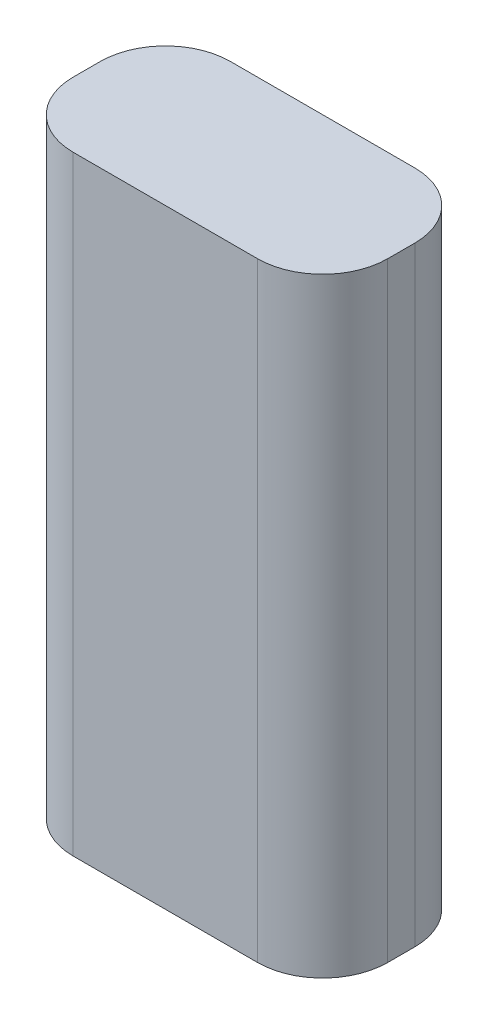
ISO-10303-21;
HEADER;
FILE_DESCRIPTION(('STEP AP214'),'2;1');
FILE_NAME('part.step','',(''),(''),'','','');
FILE_SCHEMA(('AUTOMOTIVE_DESIGN { 1 0 10303 214 1 1 1 1 }'));
ENDSEC;
DATA;
#1=APPLICATION_CONTEXT('core data for automotive mechanical design processes');
#2=APPLICATION_PROTOCOL_DEFINITION('international standard','automotive_design',2000,#1);
#3=PRODUCT_CONTEXT('',#1,'mechanical');
#4=PRODUCT('Part','Part','',(#3));
#5=PRODUCT_RELATED_PRODUCT_CATEGORY('part','',(#4));
#6=PRODUCT_DEFINITION_FORMATION('','',#4);
#7=PRODUCT_DEFINITION_CONTEXT('part definition',#1,'design');
#8=PRODUCT_DEFINITION('design','',#6,#7);
#9=PRODUCT_DEFINITION_SHAPE('','',#8);
#10=(LENGTH_UNIT() NAMED_UNIT(*) SI_UNIT(.MILLI.,.METRE.));
#11=(NAMED_UNIT(*) PLANE_ANGLE_UNIT() SI_UNIT($,.RADIAN.));
#12=(NAMED_UNIT(*) SI_UNIT($,.STERADIAN.) SOLID_ANGLE_UNIT());
#13=UNCERTAINTY_MEASURE_WITH_UNIT(LENGTH_MEASURE(1.E-05),#10,'distance_accuracy_value','');
#14=(GEOMETRIC_REPRESENTATION_CONTEXT(3) GLOBAL_UNCERTAINTY_ASSIGNED_CONTEXT((#13)) GLOBAL_UNIT_ASSIGNED_CONTEXT((#10,
#11,#12)) REPRESENTATION_CONTEXT('',''));
#15=CARTESIAN_POINT('',(0.,0.,0.));
#16=DIRECTION('',(0.,0.,1.));
#17=DIRECTION('',(1.,0.,0.));
#18=AXIS2_PLACEMENT_3D('',#15,#16,#17);
#19=CARTESIAN_POINT('',(0.,0.,18.415));
#20=DIRECTION('',(1.,0.,0.));
#21=DIRECTION('',(0.,1.,0.));
#22=AXIS2_PLACEMENT_3D('',#19,#20,#21);
#23=PLANE('',#22);
#24=DIRECTION('',(0.,0.,-1.));
#25=VECTOR('',#24,1.);
#26=CARTESIAN_POINT('',(0.,0.,18.415));
#27=LINE('',#26,#25);
#28=CARTESIAN_POINT('',(0.,0.,10.795));
#29=VERTEX_POINT('',#28);
#30=CARTESIAN_POINT('',(0.,0.,7.62));
#31=VERTEX_POINT('',#30);
#32=EDGE_CURVE('E182',#29,#31,#27,.T.);
#33=ORIENTED_EDGE('',*,*,#32,.T.);
#34=DIRECTION('',(0.,-1.,0.));
#35=VECTOR('',#34,1.);
#36=CARTESIAN_POINT('',(0.,0.,7.62));
#37=LINE('',#36,#35);
#38=CARTESIAN_POINT('',(0.,-71.374,7.62));
#39=VERTEX_POINT('',#38);
#40=EDGE_CURVE('E130',#31,#39,#37,.T.);
#41=ORIENTED_EDGE('',*,*,#40,.T.);
#42=DIRECTION('',(0.,0.,-1.));
#43=VECTOR('',#42,1.);
#44=CARTESIAN_POINT('',(0.,-71.374,18.415));
#45=LINE('',#44,#43);
#46=CARTESIAN_POINT('',(0.,-71.374,10.795));
#47=VERTEX_POINT('',#46);
#48=EDGE_CURVE('E114',#47,#39,#45,.T.);
#49=ORIENTED_EDGE('',*,*,#48,.F.);
#50=DIRECTION('',(0.,-1.,0.));
#51=VECTOR('',#50,1.);
#52=CARTESIAN_POINT('',(0.,0.,10.795));
#53=LINE('',#52,#51);
#54=EDGE_CURVE('E127',#47,#29,#53,.F.);
#55=ORIENTED_EDGE('',*,*,#54,.T.);
#56=EDGE_LOOP('',(#33,#41,#49,#55));
#57=FACE_BOUND('',#56,.T.);
#58=ADVANCED_FACE('F43',(#57),#23,.F.);
#59=CARTESIAN_POINT('',(0.,-71.374,18.415));
#60=DIRECTION('',(0.,1.,0.));
#61=DIRECTION('',(0.,0.,1.));
#62=AXIS2_PLACEMENT_3D('',#59,#60,#61);
#63=PLANE('',#62);
#64=ORIENTED_EDGE('',*,*,#48,.T.);
#65=CARTESIAN_POINT('',(7.62000000000001,-71.374,7.62));
#66=DIRECTION('',(0.,1.,0.));
#67=DIRECTION('',(0.,0.,1.));
#68=AXIS2_PLACEMENT_3D('',#65,#66,#67);
#69=CIRCLE('',#68,7.62);
#70=CARTESIAN_POINT('',(7.62000000000001,-71.374,0.));
#71=VERTEX_POINT('',#70);
#72=EDGE_CURVE('E147',#39,#71,#69,.F.);
#73=ORIENTED_EDGE('',*,*,#72,.T.);
#74=DIRECTION('',(1.,0.,0.));
#75=VECTOR('',#74,1.);
#76=CARTESIAN_POINT('',(0.,-71.374,0.));
#77=LINE('',#76,#75);
#78=CARTESIAN_POINT('',(29.21,-71.374,0.));
#79=VERTEX_POINT('',#78);
#80=EDGE_CURVE('E191',#71,#79,#77,.T.);
#81=ORIENTED_EDGE('',*,*,#80,.T.);
#82=CARTESIAN_POINT('',(29.21,-71.374,7.62));
#83=DIRECTION('',(0.,1.,0.));
#84=DIRECTION('',(0.,0.,1.));
#85=AXIS2_PLACEMENT_3D('',#82,#83,#84);
#86=CIRCLE('',#85,7.62);
#87=CARTESIAN_POINT('',(36.83,-71.374,7.62));
#88=VERTEX_POINT('',#87);
#89=EDGE_CURVE('E121',#79,#88,#86,.F.);
#90=ORIENTED_EDGE('',*,*,#89,.T.);
#91=DIRECTION('',(0.,0.,-1.));
#92=VECTOR('',#91,1.);
#93=CARTESIAN_POINT('',(36.83,-71.374,18.415));
#94=LINE('',#93,#92);
#95=CARTESIAN_POINT('',(36.83,-71.374,10.795));
#96=VERTEX_POINT('',#95);
#97=EDGE_CURVE('E132',#96,#88,#94,.T.);
#98=ORIENTED_EDGE('',*,*,#97,.F.);
#99=CARTESIAN_POINT('',(29.21,-71.374,10.795));
#100=DIRECTION('',(0.,1.,0.));
#101=DIRECTION('',(0.,0.,1.));
#102=AXIS2_PLACEMENT_3D('',#99,#100,#101);
#103=CIRCLE('',#102,7.62);
#104=CARTESIAN_POINT('',(29.21,-71.374,18.415));
#105=VERTEX_POINT('',#104);
#106=EDGE_CURVE('E122',#96,#105,#103,.F.);
#107=ORIENTED_EDGE('',*,*,#106,.T.);
#108=DIRECTION('',(1.,0.,0.));
#109=VECTOR('',#108,1.);
#110=CARTESIAN_POINT('',(0.,-71.374,18.415));
#111=LINE('',#110,#109);
#112=CARTESIAN_POINT('',(7.62000000000001,-71.374,18.415));
#113=VERTEX_POINT('',#112);
#114=EDGE_CURVE('E116',#113,#105,#111,.T.);
#115=ORIENTED_EDGE('',*,*,#114,.F.);
#116=CARTESIAN_POINT('',(7.62000000000001,-71.374,10.795));
#117=DIRECTION('',(0.,1.,0.));
#118=DIRECTION('',(0.,0.,1.));
#119=AXIS2_PLACEMENT_3D('',#116,#117,#118);
#120=CIRCLE('',#119,7.62);
#121=EDGE_CURVE('E111',#113,#47,#120,.F.);
#122=ORIENTED_EDGE('',*,*,#121,.T.);
#123=EDGE_LOOP('',(#64,#73,#81,#90,#98,#107,#115,#122));
#124=FACE_BOUND('',#123,.T.);
#125=ADVANCED_FACE('F113',(#124),#63,.F.);
#126=CARTESIAN_POINT('',(36.83,0.,18.415));
#127=DIRECTION('',(-1.,0.,0.));
#128=DIRECTION('',(0.,0.,1.));
#129=AXIS2_PLACEMENT_3D('',#126,#127,#128);
#130=PLANE('',#129);
#131=ORIENTED_EDGE('',*,*,#97,.T.);
#132=DIRECTION('',(0.,1.,0.));
#133=VECTOR('',#132,1.);
#134=CARTESIAN_POINT('',(36.83,0.,7.62));
#135=LINE('',#134,#133);
#136=CARTESIAN_POINT('',(36.83,0.,7.62));
#137=VERTEX_POINT('',#136);
#138=EDGE_CURVE('E168',#88,#137,#135,.T.);
#139=ORIENTED_EDGE('',*,*,#138,.T.);
#140=DIRECTION('',(0.,0.,-1.));
#141=VECTOR('',#140,1.);
#142=CARTESIAN_POINT('',(36.83,0.,18.415));
#143=LINE('',#142,#141);
#144=CARTESIAN_POINT('',(36.83,0.,10.795));
#145=VERTEX_POINT('',#144);
#146=EDGE_CURVE('E186',#145,#137,#143,.T.);
#147=ORIENTED_EDGE('',*,*,#146,.F.);
#148=DIRECTION('',(0.,1.,0.));
#149=VECTOR('',#148,1.);
#150=CARTESIAN_POINT('',(36.83,-71.374,10.795));
#151=LINE('',#150,#149);
#152=EDGE_CURVE('E165',#145,#96,#151,.F.);
#153=ORIENTED_EDGE('',*,*,#152,.T.);
#154=EDGE_LOOP('',(#131,#139,#147,#153));
#155=FACE_BOUND('',#154,.T.);
#156=ADVANCED_FACE('F202',(#155),#130,.F.);
#157=CARTESIAN_POINT('',(0.,0.,18.415));
#158=DIRECTION('',(0.,-1.,0.));
#159=DIRECTION('',(0.,0.,-1.));
#160=AXIS2_PLACEMENT_3D('',#157,#158,#159);
#161=PLANE('',#160);
#162=DIRECTION('',(-1.,0.,0.));
#163=VECTOR('',#162,1.);
#164=CARTESIAN_POINT('',(0.,0.,0.));
#165=LINE('',#164,#163);
#166=CARTESIAN_POINT('',(29.21,0.,0.));
#167=VERTEX_POINT('',#166);
#168=CARTESIAN_POINT('',(7.62,0.,0.));
#169=VERTEX_POINT('',#168);
#170=EDGE_CURVE('E188',#167,#169,#165,.T.);
#171=ORIENTED_EDGE('',*,*,#170,.T.);
#172=CARTESIAN_POINT('',(7.62,0.,7.62));
#173=DIRECTION('',(0.,-1.,0.));
#174=DIRECTION('',(0.,0.,-1.));
#175=AXIS2_PLACEMENT_3D('',#172,#173,#174);
#176=CIRCLE('',#175,7.62);
#177=EDGE_CURVE('E162',#169,#31,#176,.F.);
#178=ORIENTED_EDGE('',*,*,#177,.T.);
#179=ORIENTED_EDGE('',*,*,#32,.F.);
#180=CARTESIAN_POINT('',(7.62,0.,10.795));
#181=DIRECTION('',(0.,-1.,0.));
#182=DIRECTION('',(0.,0.,-1.));
#183=AXIS2_PLACEMENT_3D('',#180,#181,#182);
#184=CIRCLE('',#183,7.62);
#185=CARTESIAN_POINT('',(7.62,0.,18.415));
#186=VERTEX_POINT('',#185);
#187=EDGE_CURVE('E136',#29,#186,#184,.F.);
#188=ORIENTED_EDGE('',*,*,#187,.T.);
#189=DIRECTION('',(-1.,0.,0.));
#190=VECTOR('',#189,1.);
#191=CARTESIAN_POINT('',(0.,0.,18.415));
#192=LINE('',#191,#190);
#193=CARTESIAN_POINT('',(29.21,0.,18.415));
#194=VERTEX_POINT('',#193);
#195=EDGE_CURVE('E176',#194,#186,#192,.T.);
#196=ORIENTED_EDGE('',*,*,#195,.F.);
#197=CARTESIAN_POINT('',(29.21,0.,10.795));
#198=DIRECTION('',(0.,-1.,0.));
#199=DIRECTION('',(0.,0.,-1.));
#200=AXIS2_PLACEMENT_3D('',#197,#198,#199);
#201=CIRCLE('',#200,7.62);
#202=EDGE_CURVE('E67',#194,#145,#201,.F.);
#203=ORIENTED_EDGE('',*,*,#202,.T.);
#204=ORIENTED_EDGE('',*,*,#146,.T.);
#205=CARTESIAN_POINT('',(29.21,0.,7.62));
#206=DIRECTION('',(0.,-1.,0.));
#207=DIRECTION('',(0.,0.,-1.));
#208=AXIS2_PLACEMENT_3D('',#205,#206,#207);
#209=CIRCLE('',#208,7.62);
#210=EDGE_CURVE('E59',#137,#167,#209,.F.);
#211=ORIENTED_EDGE('',*,*,#210,.T.);
#212=EDGE_LOOP('',(#171,#178,#179,#188,#196,#203,#204,#211));
#213=FACE_BOUND('',#212,.T.);
#214=ADVANCED_FACE('F180',(#213),#161,.F.);
#215=CARTESIAN_POINT('',(0.,0.,18.415));
#216=DIRECTION('',(0.,0.,1.));
#217=DIRECTION('',(1.,0.,0.));
#218=AXIS2_PLACEMENT_3D('',#215,#216,#217);
#219=PLANE('',#218);
#220=ORIENTED_EDGE('',*,*,#195,.T.);
#221=DIRECTION('',(0.,-1.,0.));
#222=VECTOR('',#221,1.);
#223=CARTESIAN_POINT('',(7.62000000000001,-71.374,18.415));
#224=LINE('',#223,#222);
#225=EDGE_CURVE('E11',#186,#113,#224,.T.);
#226=ORIENTED_EDGE('',*,*,#225,.T.);
#227=ORIENTED_EDGE('',*,*,#114,.T.);
#228=DIRECTION('',(0.,1.,0.));
#229=VECTOR('',#228,1.);
#230=CARTESIAN_POINT('',(29.21,0.,18.415));
#231=LINE('',#230,#229);
#232=EDGE_CURVE('E52',#105,#194,#231,.T.);
#233=ORIENTED_EDGE('',*,*,#232,.T.);
#234=EDGE_LOOP('',(#220,#226,#227,#233));
#235=FACE_BOUND('',#234,.T.);
#236=ADVANCED_FACE('F175',(#235),#219,.T.);
#237=CARTESIAN_POINT('',(0.,0.,0.));
#238=DIRECTION('',(0.,0.,1.));
#239=DIRECTION('',(1.,0.,0.));
#240=AXIS2_PLACEMENT_3D('',#237,#238,#239);
#241=PLANE('',#240);
#242=ORIENTED_EDGE('',*,*,#80,.F.);
#243=DIRECTION('',(0.,-1.,0.));
#244=VECTOR('',#243,1.);
#245=CARTESIAN_POINT('',(7.62,0.,0.));
#246=LINE('',#245,#244);
#247=EDGE_CURVE('E153',#71,#169,#246,.F.);
#248=ORIENTED_EDGE('',*,*,#247,.T.);
#249=ORIENTED_EDGE('',*,*,#170,.F.);
#250=DIRECTION('',(0.,1.,0.));
#251=VECTOR('',#250,1.);
#252=CARTESIAN_POINT('',(29.21,0.,0.));
#253=LINE('',#252,#251);
#254=EDGE_CURVE('E150',#167,#79,#253,.F.);
#255=ORIENTED_EDGE('',*,*,#254,.T.);
#256=EDGE_LOOP('',(#242,#248,#249,#255));
#257=FACE_BOUND('',#256,.T.);
#258=ADVANCED_FACE('F209',(#257),#241,.F.);
#259=CARTESIAN_POINT('',(7.62,0.,7.62));
#260=DIRECTION('',(0.,-1.,0.));
#261=DIRECTION('',(1.,0.,0.));
#262=AXIS2_PLACEMENT_3D('',#259,#260,#261);
#263=CYLINDRICAL_SURFACE('',#262,7.62);
#264=ORIENTED_EDGE('',*,*,#177,.F.);
#265=ORIENTED_EDGE('',*,*,#247,.F.);
#266=ORIENTED_EDGE('',*,*,#72,.F.);
#267=ORIENTED_EDGE('',*,*,#40,.F.);
#268=EDGE_LOOP('',(#264,#265,#266,#267));
#269=FACE_BOUND('',#268,.T.);
#270=ADVANCED_FACE('F213',(#269),#263,.T.);
#271=CARTESIAN_POINT('',(29.21,0.,7.62));
#272=DIRECTION('',(0.,1.,0.));
#273=DIRECTION('',(0.,0.,1.));
#274=AXIS2_PLACEMENT_3D('',#271,#272,#273);
#275=CYLINDRICAL_SURFACE('',#274,7.62);
#276=ORIENTED_EDGE('',*,*,#89,.F.);
#277=ORIENTED_EDGE('',*,*,#254,.F.);
#278=ORIENTED_EDGE('',*,*,#210,.F.);
#279=ORIENTED_EDGE('',*,*,#138,.F.);
#280=EDGE_LOOP('',(#276,#277,#278,#279));
#281=FACE_BOUND('',#280,.T.);
#282=ADVANCED_FACE('F205',(#281),#275,.T.);
#283=CARTESIAN_POINT('',(7.62,0.,10.795));
#284=DIRECTION('',(0.,1.,0.));
#285=DIRECTION('',(-1.,0.,0.));
#286=AXIS2_PLACEMENT_3D('',#283,#284,#285);
#287=CYLINDRICAL_SURFACE('',#286,7.62);
#288=ORIENTED_EDGE('',*,*,#187,.F.);
#289=ORIENTED_EDGE('',*,*,#54,.F.);
#290=ORIENTED_EDGE('',*,*,#121,.F.);
#291=ORIENTED_EDGE('',*,*,#225,.F.);
#292=EDGE_LOOP('',(#288,#289,#290,#291));
#293=FACE_BOUND('',#292,.T.);
#294=ADVANCED_FACE('F135',(#293),#287,.T.);
#295=CARTESIAN_POINT('',(29.21,0.,10.795));
#296=DIRECTION('',(0.,-1.,0.));
#297=DIRECTION('',(0.,0.,-1.));
#298=AXIS2_PLACEMENT_3D('',#295,#296,#297);
#299=CYLINDRICAL_SURFACE('',#298,7.62);
#300=ORIENTED_EDGE('',*,*,#106,.F.);
#301=ORIENTED_EDGE('',*,*,#152,.F.);
#302=ORIENTED_EDGE('',*,*,#202,.F.);
#303=ORIENTED_EDGE('',*,*,#232,.F.);
#304=EDGE_LOOP('',(#300,#301,#302,#303));
#305=FACE_BOUND('',#304,.T.);
#306=ADVANCED_FACE('F45',(#305),#299,.T.);
#307=CLOSED_SHELL('',(#58,#125,#156,#214,#236,#258,#270,#282,#294,#306));
#308=MANIFOLD_SOLID_BREP('B2',#307);
#309=ADVANCED_BREP_SHAPE_REPRESENTATION('',(#18,#308),#14);
#310=SHAPE_DEFINITION_REPRESENTATION(#9,#309);
ENDSEC;
END-ISO-10303-21;
